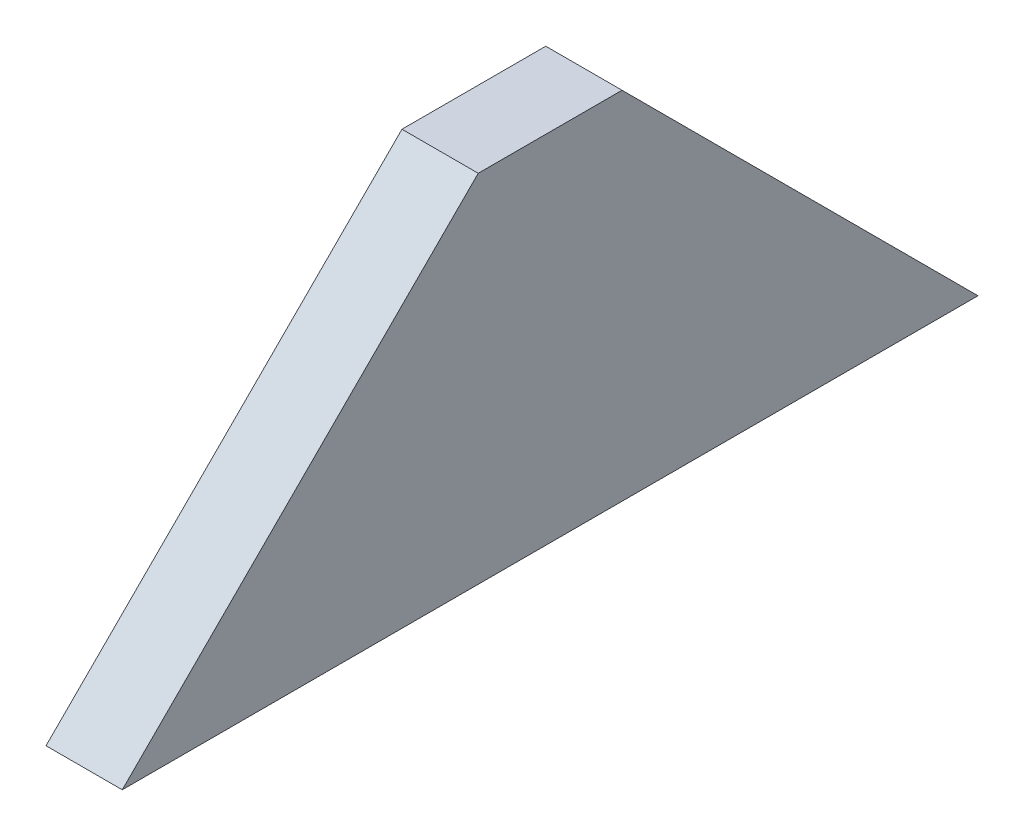
ISO-10303-21;
HEADER;
FILE_DESCRIPTION(('STEP AP214'),'2;1');
FILE_NAME('part.step','',(''),(''),'','','');
FILE_SCHEMA(('AUTOMOTIVE_DESIGN { 1 0 10303 214 1 1 1 1 }'));
ENDSEC;
DATA;
#1=APPLICATION_CONTEXT('core data for automotive mechanical design processes');
#2=APPLICATION_PROTOCOL_DEFINITION('international standard','automotive_design',2000,#1);
#3=PRODUCT_CONTEXT('',#1,'mechanical');
#4=PRODUCT('Part','Part','',(#3));
#5=PRODUCT_RELATED_PRODUCT_CATEGORY('part','',(#4));
#6=PRODUCT_DEFINITION_FORMATION('','',#4);
#7=PRODUCT_DEFINITION_CONTEXT('part definition',#1,'design');
#8=PRODUCT_DEFINITION('design','',#6,#7);
#9=PRODUCT_DEFINITION_SHAPE('','',#8);
#10=(LENGTH_UNIT() NAMED_UNIT(*) SI_UNIT(.MILLI.,.METRE.));
#11=(NAMED_UNIT(*) PLANE_ANGLE_UNIT() SI_UNIT($,.RADIAN.));
#12=(NAMED_UNIT(*) SI_UNIT($,.STERADIAN.) SOLID_ANGLE_UNIT());
#13=UNCERTAINTY_MEASURE_WITH_UNIT(LENGTH_MEASURE(1.E-05),#10,'distance_accuracy_value','');
#14=(GEOMETRIC_REPRESENTATION_CONTEXT(3) GLOBAL_UNCERTAINTY_ASSIGNED_CONTEXT((#13)) GLOBAL_UNIT_ASSIGNED_CONTEXT((#10,
#11,#12)) REPRESENTATION_CONTEXT('',''));
#15=CARTESIAN_POINT('',(0.,0.,0.));
#16=DIRECTION('',(0.,0.,1.));
#17=DIRECTION('',(1.,0.,0.));
#18=AXIS2_PLACEMENT_3D('',#15,#16,#17);
#19=CARTESIAN_POINT('',(-19.05,18.430487804878,-74.3414634146341));
#20=DIRECTION('',(0.,0.707106781186547,0.707106781186548));
#21=DIRECTION('',(0.,-0.707106781186548,0.707106781186547));
#22=AXIS2_PLACEMENT_3D('',#19,#20,#21);
#23=PLANE('',#22);
#24=DIRECTION('',(0.,-0.707106781186548,0.707106781186547));
#25=VECTOR('',#24,1.);
#26=CARTESIAN_POINT('',(0.,18.430487804878,-74.3414634146341));
#27=LINE('',#26,#25);
#28=CARTESIAN_POINT('',(0.,18.430487804878,-74.3414634146341));
#29=VERTEX_POINT('',#28);
#30=CARTESIAN_POINT('',(0.,-70.469512195122,14.5585365853659));
#31=VERTEX_POINT('',#30);
#32=EDGE_CURVE('E95',#29,#31,#27,.T.);
#33=ORIENTED_EDGE('',*,*,#32,.F.);
#34=DIRECTION('',(1.,0.,0.));
#35=VECTOR('',#34,1.);
#36=CARTESIAN_POINT('',(-19.05,18.430487804878,-74.3414634146341));
#37=LINE('',#36,#35);
#38=CARTESIAN_POINT('',(-19.05,18.430487804878,-74.3414634146341));
#39=VERTEX_POINT('',#38);
#40=EDGE_CURVE('E11',#39,#29,#37,.T.);
#41=ORIENTED_EDGE('',*,*,#40,.F.);
#42=DIRECTION('',(0.,-0.707106781186548,0.707106781186547));
#43=VECTOR('',#42,1.);
#44=CARTESIAN_POINT('',(-19.05,18.430487804878,-74.3414634146341));
#45=LINE('',#44,#43);
#46=CARTESIAN_POINT('',(-19.05,-70.469512195122,14.5585365853659));
#47=VERTEX_POINT('',#46);
#48=EDGE_CURVE('E89',#39,#47,#45,.T.);
#49=ORIENTED_EDGE('',*,*,#48,.T.);
#50=DIRECTION('',(1.,0.,0.));
#51=VECTOR('',#50,1.);
#52=CARTESIAN_POINT('',(-19.05,-70.469512195122,14.5585365853659));
#53=LINE('',#52,#51);
#54=EDGE_CURVE('E34',#47,#31,#53,.T.);
#55=ORIENTED_EDGE('',*,*,#54,.T.);
#56=EDGE_LOOP('',(#33,#41,#49,#55));
#57=FACE_BOUND('',#56,.T.);
#58=ADVANCED_FACE('F31',(#57),#23,.T.);
#59=CARTESIAN_POINT('',(-19.05,18.430487804878,-74.3414634146341));
#60=DIRECTION('',(0.,1.,0.));
#61=DIRECTION('',(0.,0.,1.));
#62=AXIS2_PLACEMENT_3D('',#59,#60,#61);
#63=PLANE('',#62);
#64=DIRECTION('',(0.,0.,1.));
#65=VECTOR('',#64,1.);
#66=CARTESIAN_POINT('',(0.,18.430487804878,-74.3414634146341));
#67=LINE('',#66,#65);
#68=CARTESIAN_POINT('',(0.,18.430487804878,-110.257063414634));
#69=VERTEX_POINT('',#68);
#70=EDGE_CURVE('E91',#69,#29,#67,.T.);
#71=ORIENTED_EDGE('',*,*,#70,.F.);
#72=DIRECTION('',(1.,0.,0.));
#73=VECTOR('',#72,1.);
#74=CARTESIAN_POINT('',(-19.05,18.430487804878,-110.257063414634));
#75=LINE('',#74,#73);
#76=CARTESIAN_POINT('',(-19.05,18.430487804878,-110.257063414634));
#77=VERTEX_POINT('',#76);
#78=EDGE_CURVE('E40',#77,#69,#75,.T.);
#79=ORIENTED_EDGE('',*,*,#78,.F.);
#80=DIRECTION('',(0.,0.,1.));
#81=VECTOR('',#80,1.);
#82=CARTESIAN_POINT('',(-19.05,18.430487804878,-74.3414634146341));
#83=LINE('',#82,#81);
#84=EDGE_CURVE('E86',#77,#39,#83,.T.);
#85=ORIENTED_EDGE('',*,*,#84,.T.);
#86=ORIENTED_EDGE('',*,*,#40,.T.);
#87=EDGE_LOOP('',(#71,#79,#85,#86));
#88=FACE_BOUND('',#87,.T.);
#89=ADVANCED_FACE('F105',(#88),#63,.T.);
#90=CARTESIAN_POINT('',(-19.05,18.430487804878,-110.257063414634));
#91=DIRECTION('',(0.,0.707106781186548,-0.707106781186547));
#92=DIRECTION('',(0.,0.707106781186547,0.707106781186548));
#93=AXIS2_PLACEMENT_3D('',#90,#91,#92);
#94=PLANE('',#93);
#95=DIRECTION('',(0.,0.707106781186547,0.707106781186548));
#96=VECTOR('',#95,1.);
#97=CARTESIAN_POINT('',(0.,18.430487804878,-110.257063414634));
#98=LINE('',#97,#96);
#99=CARTESIAN_POINT('',(0.,-70.469512195122,-199.157063414634));
#100=VERTEX_POINT('',#99);
#101=EDGE_CURVE('E81',#100,#69,#98,.T.);
#102=ORIENTED_EDGE('',*,*,#101,.F.);
#103=DIRECTION('',(1.,0.,0.));
#104=VECTOR('',#103,1.);
#105=CARTESIAN_POINT('',(-19.05,-70.469512195122,-199.157063414634));
#106=LINE('',#105,#104);
#107=CARTESIAN_POINT('',(-19.05,-70.469512195122,-199.157063414634));
#108=VERTEX_POINT('',#107);
#109=EDGE_CURVE('E76',#108,#100,#106,.T.);
#110=ORIENTED_EDGE('',*,*,#109,.F.);
#111=DIRECTION('',(0.,0.707106781186547,0.707106781186548));
#112=VECTOR('',#111,1.);
#113=CARTESIAN_POINT('',(-19.05,18.430487804878,-110.257063414634));
#114=LINE('',#113,#112);
#115=EDGE_CURVE('E79',#108,#77,#114,.T.);
#116=ORIENTED_EDGE('',*,*,#115,.T.);
#117=ORIENTED_EDGE('',*,*,#78,.T.);
#118=EDGE_LOOP('',(#102,#110,#116,#117));
#119=FACE_BOUND('',#118,.T.);
#120=ADVANCED_FACE('F78',(#119),#94,.T.);
#121=CARTESIAN_POINT('',(-19.05,-70.469512195122,14.5585365853659));
#122=DIRECTION('',(0.,-1.,0.));
#123=DIRECTION('',(0.,0.,-1.));
#124=AXIS2_PLACEMENT_3D('',#121,#122,#123);
#125=PLANE('',#124);
#126=DIRECTION('',(0.,0.,-1.));
#127=VECTOR('',#126,1.);
#128=CARTESIAN_POINT('',(0.,-70.469512195122,14.5585365853659));
#129=LINE('',#128,#127);
#130=EDGE_CURVE('E98',#31,#100,#129,.T.);
#131=ORIENTED_EDGE('',*,*,#130,.F.);
#132=ORIENTED_EDGE('',*,*,#54,.F.);
#133=DIRECTION('',(0.,0.,-1.));
#134=VECTOR('',#133,1.);
#135=CARTESIAN_POINT('',(-19.05,-70.469512195122,14.5585365853659));
#136=LINE('',#135,#134);
#137=EDGE_CURVE('E85',#47,#108,#136,.T.);
#138=ORIENTED_EDGE('',*,*,#137,.T.);
#139=ORIENTED_EDGE('',*,*,#109,.T.);
#140=EDGE_LOOP('',(#131,#132,#138,#139));
#141=FACE_BOUND('',#140,.T.);
#142=ADVANCED_FACE('F88',(#141),#125,.T.);
#143=CARTESIAN_POINT('',(-19.05,36.388287804878,-92.2992634146341));
#144=DIRECTION('',(1.,0.,0.));
#145=DIRECTION('',(0.,0.,-1.));
#146=AXIS2_PLACEMENT_3D('',#143,#144,#145);
#147=PLANE('',#146);
#148=ORIENTED_EDGE('',*,*,#48,.F.);
#149=ORIENTED_EDGE('',*,*,#84,.F.);
#150=ORIENTED_EDGE('',*,*,#115,.F.);
#151=ORIENTED_EDGE('',*,*,#137,.F.);
#152=EDGE_LOOP('',(#148,#149,#150,#151));
#153=FACE_BOUND('',#152,.T.);
#154=ADVANCED_FACE('F84',(#153),#147,.F.);
#155=CARTESIAN_POINT('',(0.,36.388287804878,-92.2992634146341));
#156=DIRECTION('',(1.,0.,0.));
#157=DIRECTION('',(0.,0.,-1.));
#158=AXIS2_PLACEMENT_3D('',#155,#156,#157);
#159=PLANE('',#158);
#160=ORIENTED_EDGE('',*,*,#32,.T.);
#161=ORIENTED_EDGE('',*,*,#130,.T.);
#162=ORIENTED_EDGE('',*,*,#101,.T.);
#163=ORIENTED_EDGE('',*,*,#70,.T.);
#164=EDGE_LOOP('',(#160,#161,#162,#163));
#165=FACE_BOUND('',#164,.T.);
#166=ADVANCED_FACE('F104',(#165),#159,.T.);
#167=CLOSED_SHELL('',(#58,#89,#120,#142,#154,#166));
#168=MANIFOLD_SOLID_BREP('B2',#167);
#169=ADVANCED_BREP_SHAPE_REPRESENTATION('',(#18,#168),#14);
#170=SHAPE_DEFINITION_REPRESENTATION(#9,#169);
ENDSEC;
END-ISO-10303-21;
